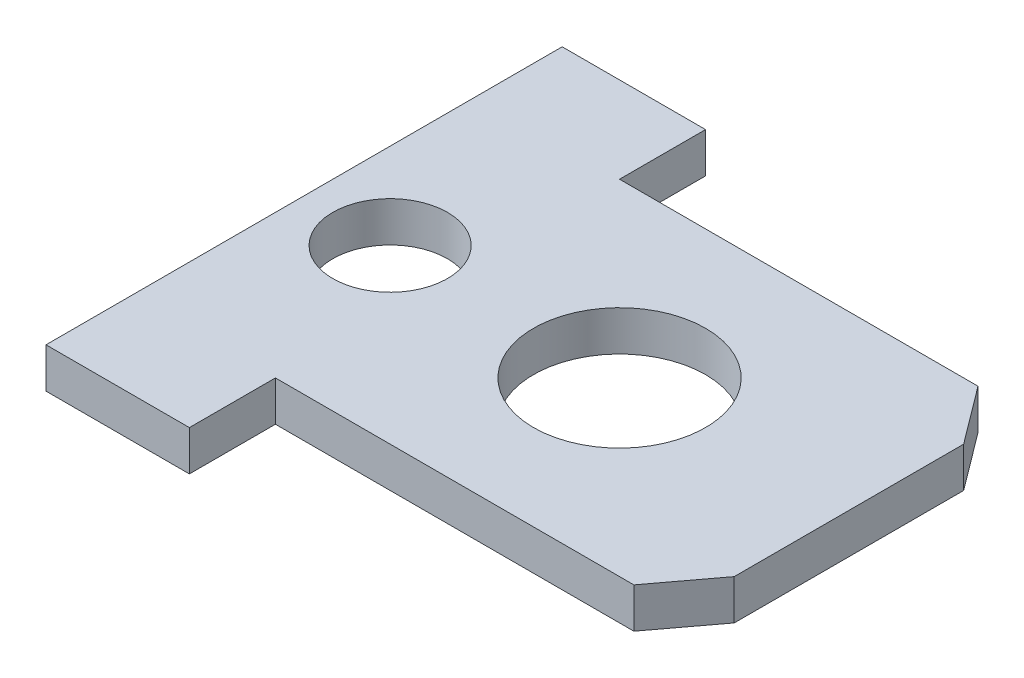
ISO-10303-21;
HEADER;
FILE_DESCRIPTION(('STEP AP214'),'2;1');
FILE_NAME('part.step','',(''),(''),'','','');
FILE_SCHEMA(('AUTOMOTIVE_DESIGN { 1 0 10303 214 1 1 1 1 }'));
ENDSEC;
DATA;
#1=APPLICATION_CONTEXT('core data for automotive mechanical design processes');
#2=APPLICATION_PROTOCOL_DEFINITION('international standard','automotive_design',2000,#1);
#3=PRODUCT_CONTEXT('',#1,'mechanical');
#4=PRODUCT('Part','Part','',(#3));
#5=PRODUCT_RELATED_PRODUCT_CATEGORY('part','',(#4));
#6=PRODUCT_DEFINITION_FORMATION('','',#4);
#7=PRODUCT_DEFINITION_CONTEXT('part definition',#1,'design');
#8=PRODUCT_DEFINITION('design','',#6,#7);
#9=PRODUCT_DEFINITION_SHAPE('','',#8);
#10=(LENGTH_UNIT() NAMED_UNIT(*) SI_UNIT(.MILLI.,.METRE.));
#11=(NAMED_UNIT(*) PLANE_ANGLE_UNIT() SI_UNIT($,.RADIAN.));
#12=(NAMED_UNIT(*) SI_UNIT($,.STERADIAN.) SOLID_ANGLE_UNIT());
#13=UNCERTAINTY_MEASURE_WITH_UNIT(LENGTH_MEASURE(1.E-05),#10,'distance_accuracy_value','');
#14=(GEOMETRIC_REPRESENTATION_CONTEXT(3) GLOBAL_UNCERTAINTY_ASSIGNED_CONTEXT((#13)) GLOBAL_UNIT_ASSIGNED_CONTEXT((#10,
#11,#12)) REPRESENTATION_CONTEXT('',''));
#15=CARTESIAN_POINT('',(0.,0.,0.));
#16=DIRECTION('',(0.,0.,1.));
#17=DIRECTION('',(1.,0.,0.));
#18=AXIS2_PLACEMENT_3D('',#15,#16,#17);
#19=CARTESIAN_POINT('',(16.,103.15,102.5));
#20=DIRECTION('',(0.,1.,0.));
#21=DIRECTION('',(0.,0.,1.));
#22=AXIS2_PLACEMENT_3D('',#19,#20,#21);
#23=PLANE('',#22);
#24=CARTESIAN_POINT('',(21.5,103.15,102.5));
#25=DIRECTION('',(0.,-1.,0.));
#26=DIRECTION('',(0.,0.,-1.));
#27=AXIS2_PLACEMENT_3D('',#24,#25,#26);
#28=CIRCLE('',#27,1.5);
#29=CARTESIAN_POINT('',(21.5,103.15,101.));
#30=VERTEX_POINT('',#29);
#31=EDGE_CURVE('E121',#30,#30,#28,.T.);
#32=ORIENTED_EDGE('',*,*,#31,.T.);
#33=EDGE_LOOP('',(#32));
#34=FACE_BOUND('',#33,.T.);
#35=CARTESIAN_POINT('',(17.5,103.15,102.5));
#36=DIRECTION('',(0.,-1.,0.));
#37=DIRECTION('',(0.,0.,-1.));
#38=AXIS2_PLACEMENT_3D('',#35,#36,#37);
#39=CIRCLE('',#38,1.);
#40=CARTESIAN_POINT('',(17.5,103.15,101.5));
#41=VERTEX_POINT('',#40);
#42=EDGE_CURVE('E20',#41,#41,#39,.T.);
#43=ORIENTED_EDGE('',*,*,#42,.T.);
#44=EDGE_LOOP('',(#43));
#45=FACE_BOUND('',#44,.T.);
#46=DIRECTION('',(0.,0.,-1.));
#47=VECTOR('',#46,1.);
#48=CARTESIAN_POINT('',(18.5,103.15,102.));
#49=LINE('',#48,#47);
#50=CARTESIAN_POINT('',(18.5,103.15,105.5));
#51=VERTEX_POINT('',#50);
#52=CARTESIAN_POINT('',(18.5,103.15,107.));
#53=VERTEX_POINT('',#52);
#54=EDGE_CURVE('E156',#51,#53,#49,.F.);
#55=ORIENTED_EDGE('',*,*,#54,.F.);
#56=DIRECTION('',(1.,0.,0.));
#57=VECTOR('',#56,1.);
#58=CARTESIAN_POINT('',(16.,103.15,105.5));
#59=LINE('',#58,#57);
#60=CARTESIAN_POINT('',(24.75,103.15,105.5));
#61=VERTEX_POINT('',#60);
#62=EDGE_CURVE('E158',#61,#51,#59,.F.);
#63=ORIENTED_EDGE('',*,*,#62,.F.);
#64=DIRECTION('',(0.6,0.,-0.8));
#65=VECTOR('',#64,1.);
#66=CARTESIAN_POINT('',(25.125,103.15,105.));
#67=LINE('',#66,#65);
#68=CARTESIAN_POINT('',(25.5,103.15,104.5));
#69=VERTEX_POINT('',#68);
#70=EDGE_CURVE('E167',#69,#61,#67,.F.);
#71=ORIENTED_EDGE('',*,*,#70,.F.);
#72=DIRECTION('',(0.,0.,-1.));
#73=VECTOR('',#72,1.);
#74=CARTESIAN_POINT('',(25.5,103.15,102.));
#75=LINE('',#74,#73);
#76=CARTESIAN_POINT('',(25.5,103.15,100.5));
#77=VERTEX_POINT('',#76);
#78=EDGE_CURVE('E99',#77,#69,#75,.F.);
#79=ORIENTED_EDGE('',*,*,#78,.F.);
#80=DIRECTION('',(-0.6,0.,-0.8));
#81=VECTOR('',#80,1.);
#82=CARTESIAN_POINT('',(25.125,103.15,100.));
#83=LINE('',#82,#81);
#84=CARTESIAN_POINT('',(24.75,103.15,99.5));
#85=VERTEX_POINT('',#84);
#86=EDGE_CURVE('E91',#85,#77,#83,.F.);
#87=ORIENTED_EDGE('',*,*,#86,.F.);
#88=DIRECTION('',(-1.,0.,0.));
#89=VECTOR('',#88,1.);
#90=CARTESIAN_POINT('',(16.,103.15,99.5));
#91=LINE('',#90,#89);
#92=CARTESIAN_POINT('',(18.5,103.15,99.5));
#93=VERTEX_POINT('',#92);
#94=EDGE_CURVE('E96',#93,#85,#91,.F.);
#95=ORIENTED_EDGE('',*,*,#94,.F.);
#96=DIRECTION('',(0.,0.,-1.));
#97=VECTOR('',#96,1.);
#98=CARTESIAN_POINT('',(18.5,103.15,102.));
#99=LINE('',#98,#97);
#100=CARTESIAN_POINT('',(18.5,103.15,98.));
#101=VERTEX_POINT('',#100);
#102=EDGE_CURVE('E130',#101,#93,#99,.F.);
#103=ORIENTED_EDGE('',*,*,#102,.F.);
#104=DIRECTION('',(-1.,0.,0.));
#105=VECTOR('',#104,1.);
#106=CARTESIAN_POINT('',(16.,103.15,98.));
#107=LINE('',#106,#105);
#108=CARTESIAN_POINT('',(16.,103.15,98.));
#109=VERTEX_POINT('',#108);
#110=EDGE_CURVE('E138',#109,#101,#107,.F.);
#111=ORIENTED_EDGE('',*,*,#110,.F.);
#112=DIRECTION('',(0.,0.,-1.));
#113=VECTOR('',#112,1.);
#114=CARTESIAN_POINT('',(16.,103.15,102.));
#115=LINE('',#114,#113);
#116=CARTESIAN_POINT('',(16.,103.15,107.));
#117=VERTEX_POINT('',#116);
#118=EDGE_CURVE('E145',#109,#117,#115,.F.);
#119=ORIENTED_EDGE('',*,*,#118,.T.);
#120=DIRECTION('',(1.,0.,0.));
#121=VECTOR('',#120,1.);
#122=CARTESIAN_POINT('',(16.,103.15,107.));
#123=LINE('',#122,#121);
#124=EDGE_CURVE('E147',#53,#117,#123,.F.);
#125=ORIENTED_EDGE('',*,*,#124,.F.);
#126=EDGE_LOOP('',(#55,#63,#71,#79,#87,#95,#103,#111,#119,#125));
#127=FACE_BOUND('',#126,.T.);
#128=ADVANCED_FACE('F17',(#34,#45,#127),#23,.T.);
#129=CARTESIAN_POINT('',(16.,102.8,99.5));
#130=DIRECTION('',(0.,0.,-1.));
#131=DIRECTION('',(-1.,0.,0.));
#132=AXIS2_PLACEMENT_3D('',#129,#130,#131);
#133=PLANE('',#132);
#134=DIRECTION('',(1.,0.,0.));
#135=VECTOR('',#134,1.);
#136=CARTESIAN_POINT('',(16.,102.45,99.5));
#137=LINE('',#136,#135);
#138=CARTESIAN_POINT('',(18.5,102.45,99.5));
#139=VERTEX_POINT('',#138);
#140=CARTESIAN_POINT('',(24.75,102.45,99.5));
#141=VERTEX_POINT('',#140);
#142=EDGE_CURVE('E123',#139,#141,#137,.T.);
#143=ORIENTED_EDGE('',*,*,#142,.F.);
#144=DIRECTION('',(0.,1.,0.));
#145=VECTOR('',#144,1.);
#146=CARTESIAN_POINT('',(18.5,102.8,99.5));
#147=LINE('',#146,#145);
#148=EDGE_CURVE('E107',#93,#139,#147,.F.);
#149=ORIENTED_EDGE('',*,*,#148,.F.);
#150=ORIENTED_EDGE('',*,*,#94,.T.);
#151=DIRECTION('',(0.,1.,0.));
#152=VECTOR('',#151,1.);
#153=CARTESIAN_POINT('',(24.75,102.45,99.5));
#154=LINE('',#153,#152);
#155=EDGE_CURVE('E101',#141,#85,#154,.T.);
#156=ORIENTED_EDGE('',*,*,#155,.F.);
#157=EDGE_LOOP('',(#143,#149,#150,#156));
#158=FACE_BOUND('',#157,.T.);
#159=ADVANCED_FACE('F104',(#158),#133,.T.);
#160=CARTESIAN_POINT('',(25.125,102.45,100.));
#161=DIRECTION('',(0.8,0.,-0.6));
#162=DIRECTION('',(-0.6,0.,-0.8));
#163=AXIS2_PLACEMENT_3D('',#160,#161,#162);
#164=PLANE('',#163);
#165=DIRECTION('',(0.6,0.,0.8));
#166=VECTOR('',#165,1.);
#167=CARTESIAN_POINT('',(24.75,102.45,99.5));
#168=LINE('',#167,#166);
#169=CARTESIAN_POINT('',(25.5,102.45,100.5));
#170=VERTEX_POINT('',#169);
#171=EDGE_CURVE('E112',#141,#170,#168,.T.);
#172=ORIENTED_EDGE('',*,*,#171,.F.);
#173=ORIENTED_EDGE('',*,*,#155,.T.);
#174=ORIENTED_EDGE('',*,*,#86,.T.);
#175=DIRECTION('',(0.,1.,0.));
#176=VECTOR('',#175,1.);
#177=CARTESIAN_POINT('',(25.5,102.8,100.5));
#178=LINE('',#177,#176);
#179=EDGE_CURVE('E114',#170,#77,#178,.T.);
#180=ORIENTED_EDGE('',*,*,#179,.F.);
#181=EDGE_LOOP('',(#172,#173,#174,#180));
#182=FACE_BOUND('',#181,.T.);
#183=ADVANCED_FACE('F110',(#182),#164,.T.);
#184=CARTESIAN_POINT('',(25.5,102.8,102.));
#185=DIRECTION('',(1.,0.,0.));
#186=DIRECTION('',(0.,0.,-1.));
#187=AXIS2_PLACEMENT_3D('',#184,#185,#186);
#188=PLANE('',#187);
#189=DIRECTION('',(0.,1.,0.));
#190=VECTOR('',#189,1.);
#191=CARTESIAN_POINT('',(25.5,102.45,104.5));
#192=LINE('',#191,#190);
#193=CARTESIAN_POINT('',(25.5,102.45,104.5));
#194=VERTEX_POINT('',#193);
#195=EDGE_CURVE('E164',#194,#69,#192,.T.);
#196=ORIENTED_EDGE('',*,*,#195,.F.);
#197=DIRECTION('',(0.,0.,-1.));
#198=VECTOR('',#197,1.);
#199=CARTESIAN_POINT('',(25.5,102.45,102.5));
#200=LINE('',#199,#198);
#201=EDGE_CURVE('E182',#170,#194,#200,.F.);
#202=ORIENTED_EDGE('',*,*,#201,.F.);
#203=ORIENTED_EDGE('',*,*,#179,.T.);
#204=ORIENTED_EDGE('',*,*,#78,.T.);
#205=EDGE_LOOP('',(#196,#202,#203,#204));
#206=FACE_BOUND('',#205,.T.);
#207=ADVANCED_FACE('F169',(#206),#188,.T.);
#208=CARTESIAN_POINT('',(25.125,102.45,105.));
#209=DIRECTION('',(0.8,0.,0.6));
#210=DIRECTION('',(0.6,0.,-0.8));
#211=AXIS2_PLACEMENT_3D('',#208,#209,#210);
#212=PLANE('',#211);
#213=DIRECTION('',(-0.6,0.,0.8));
#214=VECTOR('',#213,1.);
#215=CARTESIAN_POINT('',(25.5,102.45,104.5));
#216=LINE('',#215,#214);
#217=CARTESIAN_POINT('',(24.75,102.45,105.5));
#218=VERTEX_POINT('',#217);
#219=EDGE_CURVE('E176',#194,#218,#216,.T.);
#220=ORIENTED_EDGE('',*,*,#219,.F.);
#221=ORIENTED_EDGE('',*,*,#195,.T.);
#222=ORIENTED_EDGE('',*,*,#70,.T.);
#223=DIRECTION('',(0.,1.,0.));
#224=VECTOR('',#223,1.);
#225=CARTESIAN_POINT('',(24.75,102.8,105.5));
#226=LINE('',#225,#224);
#227=EDGE_CURVE('E161',#218,#61,#226,.T.);
#228=ORIENTED_EDGE('',*,*,#227,.F.);
#229=EDGE_LOOP('',(#220,#221,#222,#228));
#230=FACE_BOUND('',#229,.T.);
#231=ADVANCED_FACE('F173',(#230),#212,.T.);
#232=CARTESIAN_POINT('',(16.,102.8,105.5));
#233=DIRECTION('',(0.,0.,1.));
#234=DIRECTION('',(1.,0.,0.));
#235=AXIS2_PLACEMENT_3D('',#232,#233,#234);
#236=PLANE('',#235);
#237=DIRECTION('',(0.,1.,0.));
#238=VECTOR('',#237,1.);
#239=CARTESIAN_POINT('',(18.5,102.8,105.5));
#240=LINE('',#239,#238);
#241=CARTESIAN_POINT('',(18.5,102.45,105.5));
#242=VERTEX_POINT('',#241);
#243=EDGE_CURVE('E153',#242,#51,#240,.T.);
#244=ORIENTED_EDGE('',*,*,#243,.F.);
#245=DIRECTION('',(1.,0.,0.));
#246=VECTOR('',#245,1.);
#247=CARTESIAN_POINT('',(16.,102.45,105.5));
#248=LINE('',#247,#246);
#249=EDGE_CURVE('E181',#218,#242,#248,.F.);
#250=ORIENTED_EDGE('',*,*,#249,.F.);
#251=ORIENTED_EDGE('',*,*,#227,.T.);
#252=ORIENTED_EDGE('',*,*,#62,.T.);
#253=EDGE_LOOP('',(#244,#250,#251,#252));
#254=FACE_BOUND('',#253,.T.);
#255=ADVANCED_FACE('F213',(#254),#236,.T.);
#256=CARTESIAN_POINT('',(18.5,102.8,102.));
#257=DIRECTION('',(1.,0.,0.));
#258=DIRECTION('',(0.,0.,-1.));
#259=AXIS2_PLACEMENT_3D('',#256,#257,#258);
#260=PLANE('',#259);
#261=DIRECTION('',(0.,0.,-1.));
#262=VECTOR('',#261,1.);
#263=CARTESIAN_POINT('',(18.5,102.45,102.5));
#264=LINE('',#263,#262);
#265=CARTESIAN_POINT('',(18.5,102.45,107.));
#266=VERTEX_POINT('',#265);
#267=EDGE_CURVE('E189',#242,#266,#264,.F.);
#268=ORIENTED_EDGE('',*,*,#267,.F.);
#269=ORIENTED_EDGE('',*,*,#243,.T.);
#270=ORIENTED_EDGE('',*,*,#54,.T.);
#271=DIRECTION('',(0.,1.,0.));
#272=VECTOR('',#271,1.);
#273=CARTESIAN_POINT('',(18.5,102.8,107.));
#274=LINE('',#273,#272);
#275=EDGE_CURVE('E150',#266,#53,#274,.T.);
#276=ORIENTED_EDGE('',*,*,#275,.F.);
#277=EDGE_LOOP('',(#268,#269,#270,#276));
#278=FACE_BOUND('',#277,.T.);
#279=ADVANCED_FACE('F215',(#278),#260,.T.);
#280=CARTESIAN_POINT('',(16.,102.8,107.));
#281=DIRECTION('',(0.,0.,1.));
#282=DIRECTION('',(1.,0.,0.));
#283=AXIS2_PLACEMENT_3D('',#280,#281,#282);
#284=PLANE('',#283);
#285=DIRECTION('',(0.,1.,0.));
#286=VECTOR('',#285,1.);
#287=CARTESIAN_POINT('',(16.,102.8,107.));
#288=LINE('',#287,#286);
#289=CARTESIAN_POINT('',(16.,102.45,107.));
#290=VERTEX_POINT('',#289);
#291=EDGE_CURVE('E143',#117,#290,#288,.F.);
#292=ORIENTED_EDGE('',*,*,#291,.T.);
#293=DIRECTION('',(1.,0.,0.));
#294=VECTOR('',#293,1.);
#295=CARTESIAN_POINT('',(16.,102.45,107.));
#296=LINE('',#295,#294);
#297=EDGE_CURVE('E192',#266,#290,#296,.F.);
#298=ORIENTED_EDGE('',*,*,#297,.F.);
#299=ORIENTED_EDGE('',*,*,#275,.T.);
#300=ORIENTED_EDGE('',*,*,#124,.T.);
#301=EDGE_LOOP('',(#292,#298,#299,#300));
#302=FACE_BOUND('',#301,.T.);
#303=ADVANCED_FACE('F210',(#302),#284,.T.);
#304=CARTESIAN_POINT('',(16.,102.8,102.));
#305=DIRECTION('',(1.,0.,0.));
#306=DIRECTION('',(0.,0.,-1.));
#307=AXIS2_PLACEMENT_3D('',#304,#305,#306);
#308=PLANE('',#307);
#309=ORIENTED_EDGE('',*,*,#291,.F.);
#310=ORIENTED_EDGE('',*,*,#118,.F.);
#311=DIRECTION('',(0.,1.,0.));
#312=VECTOR('',#311,1.);
#313=CARTESIAN_POINT('',(16.,102.8,98.));
#314=LINE('',#313,#312);
#315=CARTESIAN_POINT('',(16.,102.45,98.));
#316=VERTEX_POINT('',#315);
#317=EDGE_CURVE('E140',#316,#109,#314,.T.);
#318=ORIENTED_EDGE('',*,*,#317,.F.);
#319=DIRECTION('',(0.,0.,-1.));
#320=VECTOR('',#319,1.);
#321=CARTESIAN_POINT('',(16.,102.45,102.5));
#322=LINE('',#321,#320);
#323=EDGE_CURVE('E195',#290,#316,#322,.T.);
#324=ORIENTED_EDGE('',*,*,#323,.F.);
#325=EDGE_LOOP('',(#309,#310,#318,#324));
#326=FACE_BOUND('',#325,.T.);
#327=ADVANCED_FACE('F207',(#326),#308,.F.);
#328=CARTESIAN_POINT('',(16.,102.8,98.));
#329=DIRECTION('',(0.,0.,-1.));
#330=DIRECTION('',(-1.,0.,0.));
#331=AXIS2_PLACEMENT_3D('',#328,#329,#330);
#332=PLANE('',#331);
#333=DIRECTION('',(0.,1.,0.));
#334=VECTOR('',#333,1.);
#335=CARTESIAN_POINT('',(18.5,102.8,98.));
#336=LINE('',#335,#334);
#337=CARTESIAN_POINT('',(18.5,102.45,98.));
#338=VERTEX_POINT('',#337);
#339=EDGE_CURVE('E35',#338,#101,#336,.T.);
#340=ORIENTED_EDGE('',*,*,#339,.F.);
#341=DIRECTION('',(1.,0.,0.));
#342=VECTOR('',#341,1.);
#343=CARTESIAN_POINT('',(16.,102.45,98.));
#344=LINE('',#343,#342);
#345=EDGE_CURVE('E198',#316,#338,#344,.T.);
#346=ORIENTED_EDGE('',*,*,#345,.F.);
#347=ORIENTED_EDGE('',*,*,#317,.T.);
#348=ORIENTED_EDGE('',*,*,#110,.T.);
#349=EDGE_LOOP('',(#340,#346,#347,#348));
#350=FACE_BOUND('',#349,.T.);
#351=ADVANCED_FACE('F203',(#350),#332,.T.);
#352=CARTESIAN_POINT('',(18.5,102.8,102.));
#353=DIRECTION('',(1.,0.,0.));
#354=DIRECTION('',(0.,0.,-1.));
#355=AXIS2_PLACEMENT_3D('',#352,#353,#354);
#356=PLANE('',#355);
#357=ORIENTED_EDGE('',*,*,#148,.T.);
#358=DIRECTION('',(0.,0.,-1.));
#359=VECTOR('',#358,1.);
#360=CARTESIAN_POINT('',(18.5,102.45,102.5));
#361=LINE('',#360,#359);
#362=EDGE_CURVE('E120',#338,#139,#361,.F.);
#363=ORIENTED_EDGE('',*,*,#362,.F.);
#364=ORIENTED_EDGE('',*,*,#339,.T.);
#365=ORIENTED_EDGE('',*,*,#102,.T.);
#366=EDGE_LOOP('',(#357,#363,#364,#365));
#367=FACE_BOUND('',#366,.T.);
#368=ADVANCED_FACE('F200',(#367),#356,.T.);
#369=CARTESIAN_POINT('',(17.5,102.45,102.5));
#370=DIRECTION('',(0.,-1.,0.));
#371=DIRECTION('',(0.,0.,-1.));
#372=AXIS2_PLACEMENT_3D('',#369,#370,#371);
#373=CYLINDRICAL_SURFACE('',#372,1.);
#374=CARTESIAN_POINT('',(17.5,102.45,102.5));
#375=DIRECTION('',(0.,-1.,0.));
#376=DIRECTION('',(0.,0.,-1.));
#377=AXIS2_PLACEMENT_3D('',#374,#375,#376);
#378=CIRCLE('',#377,1.);
#379=CARTESIAN_POINT('',(17.5,102.45,101.5));
#380=VERTEX_POINT('',#379);
#381=EDGE_CURVE('E26',#380,#380,#378,.F.);
#382=ORIENTED_EDGE('',*,*,#381,.F.);
#383=EDGE_LOOP('',(#382));
#384=FACE_BOUND('',#383,.T.);
#385=ORIENTED_EDGE('',*,*,#42,.F.);
#386=EDGE_LOOP('',(#385));
#387=FACE_BOUND('',#386,.T.);
#388=ADVANCED_FACE('F232',(#384,#387),#373,.F.);
#389=CARTESIAN_POINT('',(21.5,102.45,102.5));
#390=DIRECTION('',(0.,-1.,0.));
#391=DIRECTION('',(0.,0.,-1.));
#392=AXIS2_PLACEMENT_3D('',#389,#390,#391);
#393=CYLINDRICAL_SURFACE('',#392,1.5);
#394=CARTESIAN_POINT('',(21.5,102.45,102.5));
#395=DIRECTION('',(0.,-1.,0.));
#396=DIRECTION('',(0.,0.,-1.));
#397=AXIS2_PLACEMENT_3D('',#394,#395,#396);
#398=CIRCLE('',#397,1.5);
#399=CARTESIAN_POINT('',(21.5,102.45,101.));
#400=VERTEX_POINT('',#399);
#401=EDGE_CURVE('E11',#400,#400,#398,.F.);
#402=ORIENTED_EDGE('',*,*,#401,.F.);
#403=EDGE_LOOP('',(#402));
#404=FACE_BOUND('',#403,.T.);
#405=ORIENTED_EDGE('',*,*,#31,.F.);
#406=EDGE_LOOP('',(#405));
#407=FACE_BOUND('',#406,.T.);
#408=ADVANCED_FACE('F226',(#404,#407),#393,.F.);
#409=CARTESIAN_POINT('',(16.,102.45,102.5));
#410=DIRECTION('',(0.,-1.,0.));
#411=DIRECTION('',(0.,0.,-1.));
#412=AXIS2_PLACEMENT_3D('',#409,#410,#411);
#413=PLANE('',#412);
#414=ORIENTED_EDGE('',*,*,#401,.T.);
#415=EDGE_LOOP('',(#414));
#416=FACE_BOUND('',#415,.T.);
#417=ORIENTED_EDGE('',*,*,#381,.T.);
#418=EDGE_LOOP('',(#417));
#419=FACE_BOUND('',#418,.T.);
#420=ORIENTED_EDGE('',*,*,#345,.T.);
#421=ORIENTED_EDGE('',*,*,#362,.T.);
#422=ORIENTED_EDGE('',*,*,#142,.T.);
#423=ORIENTED_EDGE('',*,*,#171,.T.);
#424=ORIENTED_EDGE('',*,*,#201,.T.);
#425=ORIENTED_EDGE('',*,*,#219,.T.);
#426=ORIENTED_EDGE('',*,*,#249,.T.);
#427=ORIENTED_EDGE('',*,*,#267,.T.);
#428=ORIENTED_EDGE('',*,*,#297,.T.);
#429=ORIENTED_EDGE('',*,*,#323,.T.);
#430=EDGE_LOOP('',(#420,#421,#422,#423,#424,#425,#426,#427,#428,#429));
#431=FACE_BOUND('',#430,.T.);
#432=ADVANCED_FACE('F185',(#416,#419,#431),#413,.T.);
#433=CLOSED_SHELL('',(#128,#159,#183,#207,#231,#255,#279,#303,#327,#351,#368,#388,#408,#432));
#434=MANIFOLD_SOLID_BREP('B1',#433);
#435=ADVANCED_BREP_SHAPE_REPRESENTATION('',(#18,#434),#14);
#436=SHAPE_DEFINITION_REPRESENTATION(#9,#435);
ENDSEC;
END-ISO-10303-21;
